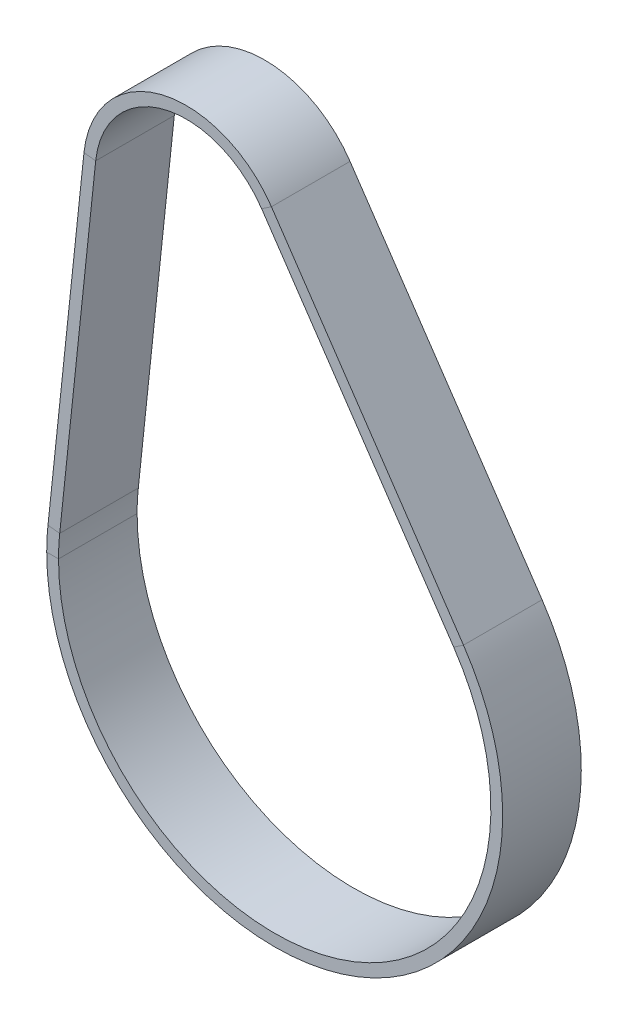
ISO-10303-21;
HEADER;
FILE_DESCRIPTION(('STEP AP214'),'2;1');
FILE_NAME('part.step','',(''),(''),'','','');
FILE_SCHEMA(('AUTOMOTIVE_DESIGN { 1 0 10303 214 1 1 1 1 }'));
ENDSEC;
DATA;
#1=APPLICATION_CONTEXT('core data for automotive mechanical design processes');
#2=APPLICATION_PROTOCOL_DEFINITION('international standard','automotive_design',2000,#1);
#3=PRODUCT_CONTEXT('',#1,'mechanical');
#4=PRODUCT('Part','Part','',(#3));
#5=PRODUCT_RELATED_PRODUCT_CATEGORY('part','',(#4));
#6=PRODUCT_DEFINITION_FORMATION('','',#4);
#7=PRODUCT_DEFINITION_CONTEXT('part definition',#1,'design');
#8=PRODUCT_DEFINITION('design','',#6,#7);
#9=PRODUCT_DEFINITION_SHAPE('','',#8);
#10=(LENGTH_UNIT() NAMED_UNIT(*) SI_UNIT(.MILLI.,.METRE.));
#11=(NAMED_UNIT(*) PLANE_ANGLE_UNIT() SI_UNIT($,.RADIAN.));
#12=(NAMED_UNIT(*) SI_UNIT($,.STERADIAN.) SOLID_ANGLE_UNIT());
#13=UNCERTAINTY_MEASURE_WITH_UNIT(LENGTH_MEASURE(1.E-05),#10,'distance_accuracy_value','');
#14=(GEOMETRIC_REPRESENTATION_CONTEXT(3) GLOBAL_UNCERTAINTY_ASSIGNED_CONTEXT((#13)) GLOBAL_UNIT_ASSIGNED_CONTEXT((#10,
#11,#12)) REPRESENTATION_CONTEXT('',''));
#15=CARTESIAN_POINT('',(0.,0.,0.));
#16=DIRECTION('',(0.,0.,1.));
#17=DIRECTION('',(1.,0.,0.));
#18=AXIS2_PLACEMENT_3D('',#15,#16,#17);
#19=CARTESIAN_POINT('',(45.5419566956062,30.8371558405688,-9.99999999999999));
#20=DIRECTION('',(0.,0.,-1.));
#21=DIRECTION('',(-1.,0.,0.));
#22=AXIS2_PLACEMENT_3D('',#19,#20,#21);
#23=PLANE('',#22);
#24=CARTESIAN_POINT('',(0.,1.69309011255336E-12,-9.99999999999999));
#25=DIRECTION('',(0.,0.,-1.));
#26=DIRECTION('',(0.828035576283765,0.560675560737593,0.));
#27=AXIS2_PLACEMENT_3D('',#24,#25,#26);
#28=CIRCLE('',#27,54.9999999999991);
#29=CARTESIAN_POINT('',(45.5419566956069,30.8371558405693,-9.99999999999999));
#30=VERTEX_POINT('',#29);
#31=CARTESIAN_POINT('',(-55.,0.,-9.99999999999999));
#32=VERTEX_POINT('',#31);
#33=EDGE_CURVE('E11',#30,#32,#28,.T.);
#34=ORIENTED_EDGE('',*,*,#33,.F.);
#35=DIRECTION('',(0.828035576283749,0.560675560737615,0.));
#36=VECTOR('',#35,1.);
#37=CARTESIAN_POINT('',(45.5419566956062,30.8371558405688,-9.99999999999999));
#38=LINE('',#37,#36);
#39=CARTESIAN_POINT('',(48.0260634244582,32.5191825227821,-9.99999999999999));
#40=VERTEX_POINT('',#39);
#41=EDGE_CURVE('E37',#30,#40,#38,.T.);
#42=ORIENTED_EDGE('',*,*,#41,.T.);
#43=CARTESIAN_POINT('',(0.,1.69309011255336E-12,-9.99999999999999));
#44=DIRECTION('',(0.,0.,-1.));
#45=DIRECTION('',(0.828035576283764,0.560675560737594,0.));
#46=AXIS2_PLACEMENT_3D('',#43,#44,#45);
#47=CIRCLE('',#46,57.9999999999991);
#48=CARTESIAN_POINT('',(-58.,0.,-9.99999999999999));
#49=VERTEX_POINT('',#48);
#50=EDGE_CURVE('E131',#40,#49,#47,.T.);
#51=ORIENTED_EDGE('',*,*,#50,.T.);
#52=DIRECTION('',(-1.,0.,0.));
#53=VECTOR('',#52,1.);
#54=CARTESIAN_POINT('',(-55.,0.,-9.99999999999999));
#55=LINE('',#54,#53);
#56=EDGE_CURVE('E134',#32,#49,#55,.T.);
#57=ORIENTED_EDGE('',*,*,#56,.F.);
#58=EDGE_LOOP('',(#34,#42,#51,#57));
#59=FACE_BOUND('',#58,.T.);
#60=ADVANCED_FACE('F34',(#59),#23,.T.);
#61=CARTESIAN_POINT('',(0.,1.69309011255336E-12,0.));
#62=DIRECTION('',(0.,0.,-1.));
#63=DIRECTION('',(-1.,0.,0.));
#64=AXIS2_PLACEMENT_3D('',#61,#62,#63);
#65=CYLINDRICAL_SURFACE('',#64,54.9999999999991);
#66=CARTESIAN_POINT('',(0.,1.69309011255336E-12,10.));
#67=DIRECTION('',(0.,0.,-1.));
#68=DIRECTION('',(0.828035576283765,0.560675560737593,0.));
#69=AXIS2_PLACEMENT_3D('',#66,#67,#68);
#70=CIRCLE('',#69,54.9999999999991);
#71=CARTESIAN_POINT('',(45.5419566956069,30.8371558405693,10.));
#72=VERTEX_POINT('',#71);
#73=CARTESIAN_POINT('',(-55.,0.,10.));
#74=VERTEX_POINT('',#73);
#75=EDGE_CURVE('E42',#72,#74,#70,.T.);
#76=ORIENTED_EDGE('',*,*,#75,.F.);
#77=DIRECTION('',(0.,0.,-1.));
#78=VECTOR('',#77,1.);
#79=CARTESIAN_POINT('',(45.5419566956062,30.8371558405688,-9.99999999999999));
#80=LINE('',#79,#78);
#81=EDGE_CURVE('E217',#72,#30,#80,.T.);
#82=ORIENTED_EDGE('',*,*,#81,.T.);
#83=ORIENTED_EDGE('',*,*,#33,.T.);
#84=DIRECTION('',(0.,0.,-1.));
#85=VECTOR('',#84,1.);
#86=CARTESIAN_POINT('',(-55.,0.,-9.99999999999999));
#87=LINE('',#86,#85);
#88=EDGE_CURVE('E159',#74,#32,#87,.T.);
#89=ORIENTED_EDGE('',*,*,#88,.F.);
#90=EDGE_LOOP('',(#76,#82,#83,#89));
#91=FACE_BOUND('',#90,.T.);
#92=ADVANCED_FACE('F276',(#91),#65,.F.);
#93=CARTESIAN_POINT('',(45.5419566956062,30.8371558405688,10.));
#94=DIRECTION('',(0.,0.,1.));
#95=DIRECTION('',(1.,0.,0.));
#96=AXIS2_PLACEMENT_3D('',#93,#94,#95);
#97=PLANE('',#96);
#98=CARTESIAN_POINT('',(0.,1.69309011255336E-12,10.));
#99=DIRECTION('',(0.,0.,-1.));
#100=DIRECTION('',(0.828035576283764,0.560675560737594,0.));
#101=AXIS2_PLACEMENT_3D('',#98,#99,#100);
#102=CIRCLE('',#101,57.9999999999991);
#103=CARTESIAN_POINT('',(48.0260634244582,32.5191825227821,10.));
#104=VERTEX_POINT('',#103);
#105=CARTESIAN_POINT('',(-58.,0.,10.));
#106=VERTEX_POINT('',#105);
#107=EDGE_CURVE('E140',#104,#106,#102,.T.);
#108=ORIENTED_EDGE('',*,*,#107,.F.);
#109=DIRECTION('',(-0.828035576283749,-0.560675560737615,0.));
#110=VECTOR('',#109,1.);
#111=CARTESIAN_POINT('',(45.5419566956062,30.8371558405688,10.));
#112=LINE('',#111,#110);
#113=EDGE_CURVE('E195',#104,#72,#112,.T.);
#114=ORIENTED_EDGE('',*,*,#113,.T.);
#115=ORIENTED_EDGE('',*,*,#75,.T.);
#116=DIRECTION('',(1.,0.,0.));
#117=VECTOR('',#116,1.);
#118=CARTESIAN_POINT('',(-55.,0.,10.));
#119=LINE('',#118,#117);
#120=EDGE_CURVE('E164',#106,#74,#119,.T.);
#121=ORIENTED_EDGE('',*,*,#120,.F.);
#122=EDGE_LOOP('',(#108,#114,#115,#121));
#123=FACE_BOUND('',#122,.T.);
#124=ADVANCED_FACE('F280',(#123),#97,.T.);
#125=CARTESIAN_POINT('',(-3.31441569750666,102.990852742292,-9.99999999999999));
#126=DIRECTION('',(0.,0.,-1.));
#127=DIRECTION('',(-1.,0.,0.));
#128=AXIS2_PLACEMENT_3D('',#125,#126,#127);
#129=PLANE('',#128);
#130=ORIENTED_EDGE('',*,*,#41,.F.);
#131=DIRECTION('',(0.560675560737615,-0.828035576283749,0.));
#132=VECTOR('',#131,1.);
#133=CARTESIAN_POINT('',(-3.31441569750666,102.990852742292,-9.99999999999999));
#134=LINE('',#133,#132);
#135=CARTESIAN_POINT('',(-3.31441569750665,102.990852742292,-9.99999999999999));
#136=VERTEX_POINT('',#135);
#137=EDGE_CURVE('E50',#136,#30,#134,.T.);
#138=ORIENTED_EDGE('',*,*,#137,.F.);
#139=DIRECTION('',(0.828035576283749,0.560675560737615,0.));
#140=VECTOR('',#139,1.);
#141=CARTESIAN_POINT('',(-3.31441569750666,102.990852742292,-9.99999999999999));
#142=LINE('',#141,#140);
#143=CARTESIAN_POINT('',(-0.830308968655401,104.672879424505,-9.99999999999999));
#144=VERTEX_POINT('',#143);
#145=EDGE_CURVE('E199',#136,#144,#142,.T.);
#146=ORIENTED_EDGE('',*,*,#145,.T.);
#147=DIRECTION('',(0.560675560737615,-0.828035576283749,0.));
#148=VECTOR('',#147,1.);
#149=CARTESIAN_POINT('',(-0.830308968655408,104.672879424505,-9.99999999999999));
#150=LINE('',#149,#148);
#151=EDGE_CURVE('E197',#144,#40,#150,.T.);
#152=ORIENTED_EDGE('',*,*,#151,.T.);
#153=EDGE_LOOP('',(#130,#138,#146,#152));
#154=FACE_BOUND('',#153,.T.);
#155=ADVANCED_FACE('F239',(#154),#129,.T.);
#156=CARTESIAN_POINT('',(-3.31441569750666,102.990852742292,-9.99999999999999));
#157=DIRECTION('',(-0.828035576283749,-0.560675560737615,0.));
#158=DIRECTION('',(0.560675560737615,-0.828035576283749,0.));
#159=AXIS2_PLACEMENT_3D('',#156,#157,#158);
#160=PLANE('',#159);
#161=ORIENTED_EDGE('',*,*,#137,.T.);
#162=ORIENTED_EDGE('',*,*,#81,.F.);
#163=DIRECTION('',(0.560675560737615,-0.828035576283749,0.));
#164=VECTOR('',#163,1.);
#165=CARTESIAN_POINT('',(-3.31441569750666,102.990852742292,10.));
#166=LINE('',#165,#164);
#167=CARTESIAN_POINT('',(-3.31441569750665,102.990852742292,10.));
#168=VERTEX_POINT('',#167);
#169=EDGE_CURVE('E59',#168,#72,#166,.T.);
#170=ORIENTED_EDGE('',*,*,#169,.F.);
#171=DIRECTION('',(0.,0.,-1.));
#172=VECTOR('',#171,1.);
#173=CARTESIAN_POINT('',(-3.31441569750666,102.990852742292,-9.99999999999999));
#174=LINE('',#173,#172);
#175=EDGE_CURVE('E214',#168,#136,#174,.T.);
#176=ORIENTED_EDGE('',*,*,#175,.T.);
#177=EDGE_LOOP('',(#161,#162,#170,#176));
#178=FACE_BOUND('',#177,.T.);
#179=ADVANCED_FACE('F265',(#178),#160,.T.);
#180=CARTESIAN_POINT('',(-3.31441569750666,102.990852742292,10.));
#181=DIRECTION('',(0.,0.,1.));
#182=DIRECTION('',(1.,0.,0.));
#183=AXIS2_PLACEMENT_3D('',#180,#181,#182);
#184=PLANE('',#183);
#185=ORIENTED_EDGE('',*,*,#169,.T.);
#186=ORIENTED_EDGE('',*,*,#113,.F.);
#187=DIRECTION('',(0.560675560737615,-0.828035576283749,0.));
#188=VECTOR('',#187,1.);
#189=CARTESIAN_POINT('',(-0.830308968655408,104.672879424505,10.));
#190=LINE('',#189,#188);
#191=CARTESIAN_POINT('',(-0.830308968655401,104.672879424505,10.));
#192=VERTEX_POINT('',#191);
#193=EDGE_CURVE('E92',#192,#104,#190,.T.);
#194=ORIENTED_EDGE('',*,*,#193,.F.);
#195=DIRECTION('',(-0.828035576283749,-0.560675560737615,0.));
#196=VECTOR('',#195,1.);
#197=CARTESIAN_POINT('',(-3.31441569750666,102.990852742292,10.));
#198=LINE('',#197,#196);
#199=EDGE_CURVE('E189',#192,#168,#198,.T.);
#200=ORIENTED_EDGE('',*,*,#199,.T.);
#201=EDGE_LOOP('',(#185,#186,#194,#200));
#202=FACE_BOUND('',#201,.T.);
#203=ADVANCED_FACE('F262',(#202),#184,.T.);
#204=CARTESIAN_POINT('',(-0.830308968655408,104.672879424505,-9.99999999999999));
#205=DIRECTION('',(0.828035576283749,0.560675560737615,0.));
#206=DIRECTION('',(-0.560675560737615,0.828035576283749,0.));
#207=AXIS2_PLACEMENT_3D('',#204,#205,#206);
#208=PLANE('',#207);
#209=ORIENTED_EDGE('',*,*,#193,.T.);
#210=DIRECTION('',(0.,0.,1.));
#211=VECTOR('',#210,1.);
#212=CARTESIAN_POINT('',(48.0260634244575,32.5191825227817,-9.99999999999999));
#213=LINE('',#212,#211);
#214=EDGE_CURVE('E193',#40,#104,#213,.T.);
#215=ORIENTED_EDGE('',*,*,#214,.F.);
#216=ORIENTED_EDGE('',*,*,#151,.F.);
#217=DIRECTION('',(0.,0.,1.));
#218=VECTOR('',#217,1.);
#219=CARTESIAN_POINT('',(-0.830308968655408,104.672879424505,-9.99999999999999));
#220=LINE('',#219,#218);
#221=EDGE_CURVE('E184',#144,#192,#220,.T.);
#222=ORIENTED_EDGE('',*,*,#221,.T.);
#223=EDGE_LOOP('',(#209,#215,#216,#222));
#224=FACE_BOUND('',#223,.T.);
#225=ADVANCED_FACE('F264',(#224),#208,.T.);
#226=CARTESIAN_POINT('',(-45.5417992044557,92.4340068655511,-9.99999999999999));
#227=DIRECTION('',(0.,0.,-1.));
#228=DIRECTION('',(-1.,0.,0.));
#229=AXIS2_PLACEMENT_3D('',#226,#227,#228);
#230=PLANE('',#229);
#231=ORIENTED_EDGE('',*,*,#145,.F.);
#232=CARTESIAN_POINT('',(-22.5000000000001,90.,-9.99999999999999));
#233=DIRECTION('',(0.,0.,-1.));
#234=DIRECTION('',(-0.994466948832783,0.105049929458401,0.));
#235=AXIS2_PLACEMENT_3D('',#232,#233,#234);
#236=CIRCLE('',#235,23.1699999999999);
#237=CARTESIAN_POINT('',(-45.5417992044555,92.4340068655511,-9.99999999999999));
#238=VERTEX_POINT('',#237);
#239=EDGE_CURVE('E229',#238,#136,#236,.T.);
#240=ORIENTED_EDGE('',*,*,#239,.F.);
#241=DIRECTION('',(-0.994466948832775,0.105049929458474,0.));
#242=VECTOR('',#241,1.);
#243=CARTESIAN_POINT('',(-45.5417992044557,92.4340068655511,-9.99999999999999));
#244=LINE('',#243,#242);
#245=CARTESIAN_POINT('',(-48.5252000509538,92.7491566539265,-9.99999999999999));
#246=VERTEX_POINT('',#245);
#247=EDGE_CURVE('E192',#238,#246,#244,.T.);
#248=ORIENTED_EDGE('',*,*,#247,.T.);
#249=CARTESIAN_POINT('',(-22.5000000000001,90.,-9.99999999999999));
#250=DIRECTION('',(0.,0.,-1.));
#251=DIRECTION('',(-0.994466948832782,0.105049929458409,0.));
#252=AXIS2_PLACEMENT_3D('',#249,#250,#251);
#253=CIRCLE('',#252,26.17);
#254=EDGE_CURVE('E187',#246,#144,#253,.T.);
#255=ORIENTED_EDGE('',*,*,#254,.T.);
#256=EDGE_LOOP('',(#231,#240,#248,#255));
#257=FACE_BOUND('',#256,.T.);
#258=ADVANCED_FACE('F244',(#257),#230,.T.);
#259=CARTESIAN_POINT('',(-22.5000000000001,90.,0.));
#260=DIRECTION('',(0.,0.,-1.));
#261=DIRECTION('',(-1.,0.,0.));
#262=AXIS2_PLACEMENT_3D('',#259,#260,#261);
#263=CYLINDRICAL_SURFACE('',#262,23.1699999999999);
#264=ORIENTED_EDGE('',*,*,#239,.T.);
#265=ORIENTED_EDGE('',*,*,#175,.F.);
#266=CARTESIAN_POINT('',(-22.5000000000001,90.,10.));
#267=DIRECTION('',(0.,0.,-1.));
#268=DIRECTION('',(-0.994466948832783,0.105049929458401,0.));
#269=AXIS2_PLACEMENT_3D('',#266,#267,#268);
#270=CIRCLE('',#269,23.1699999999999);
#271=CARTESIAN_POINT('',(-45.5417992044555,92.4340068655511,10.));
#272=VERTEX_POINT('',#271);
#273=EDGE_CURVE('E108',#272,#168,#270,.T.);
#274=ORIENTED_EDGE('',*,*,#273,.F.);
#275=DIRECTION('',(0.,0.,-1.));
#276=VECTOR('',#275,1.);
#277=CARTESIAN_POINT('',(-45.5417992044557,92.4340068655511,-9.99999999999999));
#278=LINE('',#277,#276);
#279=EDGE_CURVE('E211',#272,#238,#278,.T.);
#280=ORIENTED_EDGE('',*,*,#279,.T.);
#281=EDGE_LOOP('',(#264,#265,#274,#280));
#282=FACE_BOUND('',#281,.T.);
#283=ADVANCED_FACE('F294',(#282),#263,.F.);
#284=CARTESIAN_POINT('',(-45.5417992044557,92.4340068655511,10.));
#285=DIRECTION('',(0.,0.,1.));
#286=DIRECTION('',(1.,0.,0.));
#287=AXIS2_PLACEMENT_3D('',#284,#285,#286);
#288=PLANE('',#287);
#289=ORIENTED_EDGE('',*,*,#273,.T.);
#290=ORIENTED_EDGE('',*,*,#199,.F.);
#291=CARTESIAN_POINT('',(-22.5000000000001,90.,10.));
#292=DIRECTION('',(0.,0.,-1.));
#293=DIRECTION('',(-0.994466948832782,0.105049929458409,0.));
#294=AXIS2_PLACEMENT_3D('',#291,#292,#293);
#295=CIRCLE('',#294,26.17);
#296=CARTESIAN_POINT('',(-48.5252000509538,92.7491566539265,10.));
#297=VERTEX_POINT('',#296);
#298=EDGE_CURVE('E114',#297,#192,#295,.T.);
#299=ORIENTED_EDGE('',*,*,#298,.F.);
#300=DIRECTION('',(0.994466948832775,-0.105049929458474,0.));
#301=VECTOR('',#300,1.);
#302=CARTESIAN_POINT('',(-45.5417992044557,92.4340068655511,10.));
#303=LINE('',#302,#301);
#304=EDGE_CURVE('E180',#297,#272,#303,.T.);
#305=ORIENTED_EDGE('',*,*,#304,.T.);
#306=EDGE_LOOP('',(#289,#290,#299,#305));
#307=FACE_BOUND('',#306,.T.);
#308=ADVANCED_FACE('F261',(#307),#288,.T.);
#309=CARTESIAN_POINT('',(-22.5000000000001,90.,0.));
#310=DIRECTION('',(0.,0.,-1.));
#311=DIRECTION('',(-1.,0.,0.));
#312=AXIS2_PLACEMENT_3D('',#309,#310,#311);
#313=CYLINDRICAL_SURFACE('',#312,26.17);
#314=ORIENTED_EDGE('',*,*,#298,.T.);
#315=ORIENTED_EDGE('',*,*,#221,.F.);
#316=ORIENTED_EDGE('',*,*,#254,.F.);
#317=DIRECTION('',(0.,0.,1.));
#318=VECTOR('',#317,1.);
#319=CARTESIAN_POINT('',(-48.525200050954,92.7491566539266,-9.99999999999999));
#320=LINE('',#319,#318);
#321=EDGE_CURVE('E173',#246,#297,#320,.T.);
#322=ORIENTED_EDGE('',*,*,#321,.T.);
#323=EDGE_LOOP('',(#314,#315,#316,#322));
#324=FACE_BOUND('',#323,.T.);
#325=ADVANCED_FACE('F242',(#324),#313,.T.);
#326=CARTESIAN_POINT('',(-54.6956821858026,5.77774612021607,-9.99999999999999));
#327=DIRECTION('',(0.,0.,-1.));
#328=DIRECTION('',(-1.,0.,0.));
#329=AXIS2_PLACEMENT_3D('',#326,#327,#328);
#330=PLANE('',#329);
#331=ORIENTED_EDGE('',*,*,#247,.F.);
#332=DIRECTION('',(0.105049929458474,0.994466948832775,0.));
#333=VECTOR('',#332,1.);
#334=CARTESIAN_POINT('',(-54.6956821858026,5.77774612021607,-9.99999999999999));
#335=LINE('',#334,#333);
#336=CARTESIAN_POINT('',(-54.6956821858028,5.77774612021608,-9.99999999999999));
#337=VERTEX_POINT('',#336);
#338=EDGE_CURVE('E225',#337,#238,#335,.T.);
#339=ORIENTED_EDGE('',*,*,#338,.F.);
#340=DIRECTION('',(-0.994466948832775,0.105049929458474,0.));
#341=VECTOR('',#340,1.);
#342=CARTESIAN_POINT('',(-54.6956821858026,5.77774612021606,-9.99999999999999));
#343=LINE('',#342,#341);
#344=CARTESIAN_POINT('',(-57.6790830323011,6.0928959085915,-9.99999999999999));
#345=VERTEX_POINT('',#344);
#346=EDGE_CURVE('E183',#337,#345,#343,.T.);
#347=ORIENTED_EDGE('',*,*,#346,.T.);
#348=DIRECTION('',(0.105049929458474,0.994466948832775,0.));
#349=VECTOR('',#348,1.);
#350=CARTESIAN_POINT('',(-57.679083032301,6.09289590859149,-9.99999999999999));
#351=LINE('',#350,#349);
#352=EDGE_CURVE('E177',#345,#246,#351,.T.);
#353=ORIENTED_EDGE('',*,*,#352,.T.);
#354=EDGE_LOOP('',(#331,#339,#347,#353));
#355=FACE_BOUND('',#354,.T.);
#356=ADVANCED_FACE('F250',(#355),#330,.T.);
#357=CARTESIAN_POINT('',(-54.6956821858026,5.77774612021607,-9.99999999999999));
#358=DIRECTION('',(0.994466948832775,-0.105049929458474,0.));
#359=DIRECTION('',(0.105049929458474,0.994466948832775,0.));
#360=AXIS2_PLACEMENT_3D('',#357,#358,#359);
#361=PLANE('',#360);
#362=ORIENTED_EDGE('',*,*,#338,.T.);
#363=ORIENTED_EDGE('',*,*,#279,.F.);
#364=DIRECTION('',(0.105049929458474,0.994466948832775,0.));
#365=VECTOR('',#364,1.);
#366=CARTESIAN_POINT('',(-54.6956821858026,5.77774612021607,10.));
#367=LINE('',#366,#365);
#368=CARTESIAN_POINT('',(-54.6956821858028,5.77774612021608,10.));
#369=VERTEX_POINT('',#368);
#370=EDGE_CURVE('E208',#369,#272,#367,.T.);
#371=ORIENTED_EDGE('',*,*,#370,.F.);
#372=DIRECTION('',(0.,0.,-1.));
#373=VECTOR('',#372,1.);
#374=CARTESIAN_POINT('',(-54.6956821858026,5.77774612021606,-9.99999999999999));
#375=LINE('',#374,#373);
#376=EDGE_CURVE('E206',#369,#337,#375,.T.);
#377=ORIENTED_EDGE('',*,*,#376,.T.);
#378=EDGE_LOOP('',(#362,#363,#371,#377));
#379=FACE_BOUND('',#378,.T.);
#380=ADVANCED_FACE('F257',(#379),#361,.T.);
#381=CARTESIAN_POINT('',(-54.6956821858026,5.77774612021607,10.));
#382=DIRECTION('',(0.,0.,1.));
#383=DIRECTION('',(1.,0.,0.));
#384=AXIS2_PLACEMENT_3D('',#381,#382,#383);
#385=PLANE('',#384);
#386=ORIENTED_EDGE('',*,*,#370,.T.);
#387=ORIENTED_EDGE('',*,*,#304,.F.);
#388=DIRECTION('',(0.105049929458474,0.994466948832775,0.));
#389=VECTOR('',#388,1.);
#390=CARTESIAN_POINT('',(-57.679083032301,6.09289590859149,10.));
#391=LINE('',#390,#389);
#392=CARTESIAN_POINT('',(-57.6790830323011,6.0928959085915,10.));
#393=VERTEX_POINT('',#392);
#394=EDGE_CURVE('E176',#393,#297,#391,.T.);
#395=ORIENTED_EDGE('',*,*,#394,.F.);
#396=DIRECTION('',(0.994466948832775,-0.105049929458474,0.));
#397=VECTOR('',#396,1.);
#398=CARTESIAN_POINT('',(-54.6956821858026,5.77774612021606,10.));
#399=LINE('',#398,#397);
#400=EDGE_CURVE('E171',#393,#369,#399,.T.);
#401=ORIENTED_EDGE('',*,*,#400,.T.);
#402=EDGE_LOOP('',(#386,#387,#395,#401));
#403=FACE_BOUND('',#402,.T.);
#404=ADVANCED_FACE('F259',(#403),#385,.T.);
#405=CARTESIAN_POINT('',(-57.679083032301,6.09289590859149,-9.99999999999999));
#406=DIRECTION('',(-0.994466948832775,0.105049929458474,0.));
#407=DIRECTION('',(-0.105049929458474,-0.994466948832775,0.));
#408=AXIS2_PLACEMENT_3D('',#405,#406,#407);
#409=PLANE('',#408);
#410=ORIENTED_EDGE('',*,*,#394,.T.);
#411=ORIENTED_EDGE('',*,*,#321,.F.);
#412=ORIENTED_EDGE('',*,*,#352,.F.);
#413=DIRECTION('',(0.,0.,1.));
#414=VECTOR('',#413,1.);
#415=CARTESIAN_POINT('',(-57.679083032301,6.09289590859149,-9.99999999999999));
#416=LINE('',#415,#414);
#417=EDGE_CURVE('E151',#345,#393,#416,.T.);
#418=ORIENTED_EDGE('',*,*,#417,.T.);
#419=EDGE_LOOP('',(#410,#411,#412,#418));
#420=FACE_BOUND('',#419,.T.);
#421=ADVANCED_FACE('F249',(#420),#409,.T.);
#422=CARTESIAN_POINT('',(-55.,0.,-9.99999999999999));
#423=DIRECTION('',(0.,0.,-1.));
#424=DIRECTION('',(-1.,0.,0.));
#425=AXIS2_PLACEMENT_3D('',#422,#423,#424);
#426=PLANE('',#425);
#427=ORIENTED_EDGE('',*,*,#346,.F.);
#428=CARTESIAN_POINT('',(0.,1.69309011255336E-12,-9.99999999999999));
#429=DIRECTION('',(0.,0.,-1.));
#430=DIRECTION('',(-1.,0.,0.));
#431=AXIS2_PLACEMENT_3D('',#428,#429,#430);
#432=CIRCLE('',#431,54.9999999999999);
#433=EDGE_CURVE('E158',#32,#337,#432,.T.);
#434=ORIENTED_EDGE('',*,*,#433,.F.);
#435=ORIENTED_EDGE('',*,*,#56,.T.);
#436=CARTESIAN_POINT('',(0.,1.69309011255336E-12,-9.99999999999999));
#437=DIRECTION('',(0.,0.,-1.));
#438=DIRECTION('',(-1.,0.,0.));
#439=AXIS2_PLACEMENT_3D('',#436,#437,#438);
#440=CIRCLE('',#439,58.);
#441=EDGE_CURVE('E146',#49,#345,#440,.T.);
#442=ORIENTED_EDGE('',*,*,#441,.T.);
#443=EDGE_LOOP('',(#427,#434,#435,#442));
#444=FACE_BOUND('',#443,.T.);
#445=ADVANCED_FACE('F156',(#444),#426,.T.);
#446=CARTESIAN_POINT('',(0.,1.69309011255336E-12,0.));
#447=DIRECTION('',(0.,0.,-1.));
#448=DIRECTION('',(-1.,0.,0.));
#449=AXIS2_PLACEMENT_3D('',#446,#447,#448);
#450=CYLINDRICAL_SURFACE('',#449,54.9999999999999);
#451=ORIENTED_EDGE('',*,*,#433,.T.);
#452=ORIENTED_EDGE('',*,*,#376,.F.);
#453=CARTESIAN_POINT('',(0.,1.69309011255336E-12,10.));
#454=DIRECTION('',(0.,0.,-1.));
#455=DIRECTION('',(-1.,0.,0.));
#456=AXIS2_PLACEMENT_3D('',#453,#454,#455);
#457=CIRCLE('',#456,54.9999999999999);
#458=EDGE_CURVE('E203',#74,#369,#457,.T.);
#459=ORIENTED_EDGE('',*,*,#458,.F.);
#460=ORIENTED_EDGE('',*,*,#88,.T.);
#461=EDGE_LOOP('',(#451,#452,#459,#460));
#462=FACE_BOUND('',#461,.T.);
#463=ADVANCED_FACE('F253',(#462),#450,.F.);
#464=CARTESIAN_POINT('',(-55.,0.,10.));
#465=DIRECTION('',(0.,0.,1.));
#466=DIRECTION('',(1.,0.,0.));
#467=AXIS2_PLACEMENT_3D('',#464,#465,#466);
#468=PLANE('',#467);
#469=ORIENTED_EDGE('',*,*,#458,.T.);
#470=ORIENTED_EDGE('',*,*,#400,.F.);
#471=CARTESIAN_POINT('',(0.,1.69309011255336E-12,10.));
#472=DIRECTION('',(0.,0.,-1.));
#473=DIRECTION('',(-1.,0.,0.));
#474=AXIS2_PLACEMENT_3D('',#471,#472,#473);
#475=CIRCLE('',#474,58.);
#476=EDGE_CURVE('E170',#106,#393,#475,.T.);
#477=ORIENTED_EDGE('',*,*,#476,.F.);
#478=ORIENTED_EDGE('',*,*,#120,.T.);
#479=EDGE_LOOP('',(#469,#470,#477,#478));
#480=FACE_BOUND('',#479,.T.);
#481=ADVANCED_FACE('F387',(#480),#468,.T.);
#482=CARTESIAN_POINT('',(0.,1.69309011255336E-12,0.));
#483=DIRECTION('',(0.,0.,-1.));
#484=DIRECTION('',(-1.,0.,0.));
#485=AXIS2_PLACEMENT_3D('',#482,#483,#484);
#486=CYLINDRICAL_SURFACE('',#485,58.);
#487=ORIENTED_EDGE('',*,*,#476,.T.);
#488=ORIENTED_EDGE('',*,*,#417,.F.);
#489=ORIENTED_EDGE('',*,*,#441,.F.);
#490=DIRECTION('',(0.,0.,1.));
#491=VECTOR('',#490,1.);
#492=CARTESIAN_POINT('',(-58.,0.,-9.99999999999999));
#493=LINE('',#492,#491);
#494=EDGE_CURVE('E149',#49,#106,#493,.T.);
#495=ORIENTED_EDGE('',*,*,#494,.T.);
#496=EDGE_LOOP('',(#487,#488,#489,#495));
#497=FACE_BOUND('',#496,.T.);
#498=ADVANCED_FACE('F148',(#497),#486,.T.);
#499=CARTESIAN_POINT('',(0.,1.69309011255336E-12,0.));
#500=DIRECTION('',(0.,0.,-1.));
#501=DIRECTION('',(-1.,0.,0.));
#502=AXIS2_PLACEMENT_3D('',#499,#500,#501);
#503=CYLINDRICAL_SURFACE('',#502,57.9999999999991);
#504=ORIENTED_EDGE('',*,*,#214,.T.);
#505=ORIENTED_EDGE('',*,*,#107,.T.);
#506=ORIENTED_EDGE('',*,*,#494,.F.);
#507=ORIENTED_EDGE('',*,*,#50,.F.);
#508=EDGE_LOOP('',(#504,#505,#506,#507));
#509=FACE_BOUND('',#508,.T.);
#510=ADVANCED_FACE('F161',(#509),#503,.T.);
#511=CLOSED_SHELL('',(#60,#92,#124,#155,#179,#203,#225,#258,#283,#308,#325,#356,#380,#404,#421,
#445,#463,#481,#498,#510));
#512=MANIFOLD_SOLID_BREP('B2',#511);
#513=ADVANCED_BREP_SHAPE_REPRESENTATION('',(#18,#512),#14);
#514=SHAPE_DEFINITION_REPRESENTATION(#9,#513);
ENDSEC;
END-ISO-10303-21;
